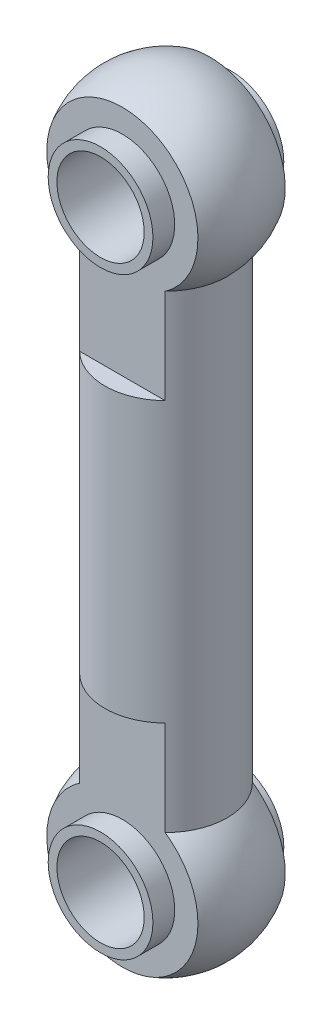
ISO-10303-21;
HEADER;
FILE_DESCRIPTION(('STEP AP214'),'2;1');
FILE_NAME('part.step','',(''),(''),'','','');
FILE_SCHEMA(('AUTOMOTIVE_DESIGN { 1 0 10303 214 1 1 1 1 }'));
ENDSEC;
DATA;
#1=APPLICATION_CONTEXT('core data for automotive mechanical design processes');
#2=APPLICATION_PROTOCOL_DEFINITION('international standard','automotive_design',2000,#1);
#3=PRODUCT_CONTEXT('',#1,'mechanical');
#4=PRODUCT('Part','Part','',(#3));
#5=PRODUCT_RELATED_PRODUCT_CATEGORY('part','',(#4));
#6=PRODUCT_DEFINITION_FORMATION('','',#4);
#7=PRODUCT_DEFINITION_CONTEXT('part definition',#1,'design');
#8=PRODUCT_DEFINITION('design','',#6,#7);
#9=PRODUCT_DEFINITION_SHAPE('','',#8);
#10=(LENGTH_UNIT() NAMED_UNIT(*) SI_UNIT(.MILLI.,.METRE.));
#11=(NAMED_UNIT(*) PLANE_ANGLE_UNIT() SI_UNIT($,.RADIAN.));
#12=(NAMED_UNIT(*) SI_UNIT($,.STERADIAN.) SOLID_ANGLE_UNIT());
#13=UNCERTAINTY_MEASURE_WITH_UNIT(LENGTH_MEASURE(1.E-05),#10,'distance_accuracy_value','');
#14=(GEOMETRIC_REPRESENTATION_CONTEXT(3) GLOBAL_UNCERTAINTY_ASSIGNED_CONTEXT((#13)) GLOBAL_UNIT_ASSIGNED_CONTEXT((#10,
#11,#12)) REPRESENTATION_CONTEXT('',''));
#15=CARTESIAN_POINT('',(0.,0.,0.));
#16=DIRECTION('',(0.,0.,1.));
#17=DIRECTION('',(1.,0.,0.));
#18=AXIS2_PLACEMENT_3D('',#15,#16,#17);
#19=CARTESIAN_POINT('',(0.,0.,2.5));
#20=DIRECTION('',(0.,0.,-1.));
#21=DIRECTION('',(-1.,0.,0.));
#22=AXIS2_PLACEMENT_3D('',#19,#20,#21);
#23=PLANE('',#22);
#24=CARTESIAN_POINT('',(0.,0.,2.5));
#25=DIRECTION('',(0.,0.,-1.));
#26=DIRECTION('',(-1.,0.,0.));
#27=AXIS2_PLACEMENT_3D('',#24,#25,#26);
#28=CIRCLE('',#27,4.33012701892219);
#29=CARTESIAN_POINT('',(-2.44948974278318,-3.57071421427142,2.5));
#30=VERTEX_POINT('',#29);
#31=CARTESIAN_POINT('',(2.44948974278318,-3.57071421427142,2.5));
#32=VERTEX_POINT('',#31);
#33=EDGE_CURVE('E63',#30,#32,#28,.T.);
#34=ORIENTED_EDGE('',*,*,#33,.F.);
#35=DIRECTION('',(0.,-1.,0.));
#36=VECTOR('',#35,1.);
#37=CARTESIAN_POINT('',(-2.44948974278318,0.,2.5));
#38=LINE('',#37,#36);
#39=CARTESIAN_POINT('',(-2.44948974278318,-9.,2.5));
#40=VERTEX_POINT('',#39);
#41=EDGE_CURVE('E185',#40,#30,#38,.F.);
#42=ORIENTED_EDGE('',*,*,#41,.F.);
#43=DIRECTION('',(1.,0.,0.));
#44=VECTOR('',#43,1.);
#45=CARTESIAN_POINT('',(-6.,-9.,2.5));
#46=LINE('',#45,#44);
#47=CARTESIAN_POINT('',(2.44948974278318,-9.,2.5));
#48=VERTEX_POINT('',#47);
#49=EDGE_CURVE('E182',#40,#48,#46,.T.);
#50=ORIENTED_EDGE('',*,*,#49,.T.);
#51=DIRECTION('',(0.,-1.,0.));
#52=VECTOR('',#51,1.);
#53=CARTESIAN_POINT('',(2.44948974278318,0.,2.5));
#54=LINE('',#53,#52);
#55=EDGE_CURVE('E188',#32,#48,#54,.T.);
#56=ORIENTED_EDGE('',*,*,#55,.F.);
#57=EDGE_LOOP('',(#34,#42,#50,#56));
#58=FACE_BOUND('',#57,.T.);
#59=CARTESIAN_POINT('',(0.,0.,2.5));
#60=DIRECTION('',(0.,0.,-1.));
#61=DIRECTION('',(-1.,0.,0.));
#62=AXIS2_PLACEMENT_3D('',#59,#60,#61);
#63=CIRCLE('',#62,3.);
#64=CARTESIAN_POINT('',(-3.,0.,2.5));
#65=VERTEX_POINT('',#64);
#66=EDGE_CURVE('E12',#65,#65,#63,.F.);
#67=ORIENTED_EDGE('',*,*,#66,.F.);
#68=EDGE_LOOP('',(#67));
#69=FACE_BOUND('',#68,.T.);
#70=ADVANCED_FACE('F39',(#58,#69),#23,.F.);
#71=CARTESIAN_POINT('',(0.,0.,-2.5));
#72=DIRECTION('',(0.,0.,1.));
#73=DIRECTION('',(-1.,0.,0.));
#74=AXIS2_PLACEMENT_3D('',#71,#72,#73);
#75=PLANE('',#74);
#76=CARTESIAN_POINT('',(0.,0.,-2.5));
#77=DIRECTION('',(0.,0.,1.));
#78=DIRECTION('',(1.,0.,0.));
#79=AXIS2_PLACEMENT_3D('',#76,#77,#78);
#80=CIRCLE('',#79,4.33012701892219);
#81=CARTESIAN_POINT('',(2.44948974278318,-3.57071421427142,-2.5));
#82=VERTEX_POINT('',#81);
#83=CARTESIAN_POINT('',(-2.44948974278318,-3.57071421427142,-2.5));
#84=VERTEX_POINT('',#83);
#85=EDGE_CURVE('E174',#82,#84,#80,.T.);
#86=ORIENTED_EDGE('',*,*,#85,.F.);
#87=DIRECTION('',(0.,-1.,0.));
#88=VECTOR('',#87,1.);
#89=CARTESIAN_POINT('',(2.44948974278318,0.,-2.5));
#90=LINE('',#89,#88);
#91=CARTESIAN_POINT('',(2.44948974278318,-9.,-2.5));
#92=VERTEX_POINT('',#91);
#93=EDGE_CURVE('E171',#92,#82,#90,.F.);
#94=ORIENTED_EDGE('',*,*,#93,.F.);
#95=DIRECTION('',(1.,0.,0.));
#96=VECTOR('',#95,1.);
#97=CARTESIAN_POINT('',(-6.,-9.,-2.5));
#98=LINE('',#97,#96);
#99=CARTESIAN_POINT('',(-2.44948974278318,-9.,-2.5));
#100=VERTEX_POINT('',#99);
#101=EDGE_CURVE('E55',#100,#92,#98,.T.);
#102=ORIENTED_EDGE('',*,*,#101,.F.);
#103=DIRECTION('',(0.,-1.,0.));
#104=VECTOR('',#103,1.);
#105=CARTESIAN_POINT('',(-2.44948974278318,0.,-2.5));
#106=LINE('',#105,#104);
#107=EDGE_CURVE('E177',#84,#100,#106,.T.);
#108=ORIENTED_EDGE('',*,*,#107,.F.);
#109=EDGE_LOOP('',(#86,#94,#102,#108));
#110=FACE_BOUND('',#109,.T.);
#111=CARTESIAN_POINT('',(0.,0.,-2.5));
#112=DIRECTION('',(0.,0.,1.));
#113=DIRECTION('',(1.,0.,0.));
#114=AXIS2_PLACEMENT_3D('',#111,#112,#113);
#115=CIRCLE('',#114,3.);
#116=CARTESIAN_POINT('',(3.,0.,-2.5));
#117=VERTEX_POINT('',#116);
#118=EDGE_CURVE('E43',#117,#117,#115,.F.);
#119=ORIENTED_EDGE('',*,*,#118,.F.);
#120=EDGE_LOOP('',(#119));
#121=FACE_BOUND('',#120,.T.);
#122=ADVANCED_FACE('F203',(#110,#121),#75,.F.);
#123=CARTESIAN_POINT('',(0.,0.,0.));
#124=DIRECTION('',(0.,-1.,0.));
#125=DIRECTION('',(1.,0.,0.));
#126=AXIS2_PLACEMENT_3D('',#123,#124,#125);
#127=SPHERICAL_SURFACE('',#126,5.);
#128=ORIENTED_EDGE('',*,*,#85,.T.);
#129=CARTESIAN_POINT('',(0.,-3.57071421427142,0.));
#130=DIRECTION('',(0.,-1.,0.));
#131=DIRECTION('',(0.,0.,-1.));
#132=AXIS2_PLACEMENT_3D('',#129,#130,#131);
#133=CIRCLE('',#132,3.5);
#134=EDGE_CURVE('E192',#30,#84,#133,.T.);
#135=ORIENTED_EDGE('',*,*,#134,.F.);
#136=ORIENTED_EDGE('',*,*,#33,.T.);
#137=EDGE_CURVE('E191',#82,#32,#133,.T.);
#138=ORIENTED_EDGE('',*,*,#137,.F.);
#139=EDGE_LOOP('',(#128,#135,#136,#138));
#140=FACE_BOUND('',#139,.T.);
#141=ADVANCED_FACE('F41',(#140),#127,.T.);
#142=CARTESIAN_POINT('',(0.,0.,0.));
#143=DIRECTION('',(0.,-1.,0.));
#144=DIRECTION('',(0.,0.,-1.));
#145=AXIS2_PLACEMENT_3D('',#142,#143,#144);
#146=CYLINDRICAL_SURFACE('',#145,3.5);
#147=ORIENTED_EDGE('',*,*,#107,.T.);
#148=CARTESIAN_POINT('',(0.,-9.,0.));
#149=DIRECTION('',(0.,-1.,0.));
#150=DIRECTION('',(0.,0.,-1.));
#151=AXIS2_PLACEMENT_3D('',#148,#149,#150);
#152=CIRCLE('',#151,3.5);
#153=EDGE_CURVE('E165',#100,#92,#152,.T.);
#154=ORIENTED_EDGE('',*,*,#153,.T.);
#155=ORIENTED_EDGE('',*,*,#93,.T.);
#156=ORIENTED_EDGE('',*,*,#137,.T.);
#157=ORIENTED_EDGE('',*,*,#55,.T.);
#158=CARTESIAN_POINT('',(0.,-9.,0.));
#159=DIRECTION('',(0.,1.,0.));
#160=DIRECTION('',(0.,0.,1.));
#161=AXIS2_PLACEMENT_3D('',#158,#159,#160);
#162=CIRCLE('',#161,3.5);
#163=EDGE_CURVE('E180',#40,#48,#162,.T.);
#164=ORIENTED_EDGE('',*,*,#163,.F.);
#165=ORIENTED_EDGE('',*,*,#41,.T.);
#166=ORIENTED_EDGE('',*,*,#134,.T.);
#167=EDGE_LOOP('',(#147,#154,#155,#156,#157,#164,#165,#166));
#168=FACE_BOUND('',#167,.T.);
#169=DIRECTION('',(0.,1.,0.));
#170=VECTOR('',#169,1.);
#171=CARTESIAN_POINT('',(-2.44948974278318,-34.,-2.5));
#172=LINE('',#171,#170);
#173=CARTESIAN_POINT('',(-2.44948974278318,-30.4292857857286,-2.5));
#174=VERTEX_POINT('',#173);
#175=CARTESIAN_POINT('',(-2.44948974278318,-25.,-2.5));
#176=VERTEX_POINT('',#175);
#177=EDGE_CURVE('E121',#174,#176,#172,.T.);
#178=ORIENTED_EDGE('',*,*,#177,.F.);
#179=CARTESIAN_POINT('',(0.,-30.4292857857286,0.));
#180=DIRECTION('',(0.,-1.,0.));
#181=DIRECTION('',(0.,0.,-1.));
#182=AXIS2_PLACEMENT_3D('',#179,#180,#181);
#183=CIRCLE('',#182,3.5);
#184=CARTESIAN_POINT('',(-2.44948974278318,-30.4292857857286,2.5));
#185=VERTEX_POINT('',#184);
#186=EDGE_CURVE('E107',#185,#174,#183,.T.);
#187=ORIENTED_EDGE('',*,*,#186,.F.);
#188=DIRECTION('',(0.,1.,0.));
#189=VECTOR('',#188,1.);
#190=CARTESIAN_POINT('',(-2.44948974278318,-34.,2.5));
#191=LINE('',#190,#189);
#192=CARTESIAN_POINT('',(-2.44948974278318,-25.,2.5));
#193=VERTEX_POINT('',#192);
#194=EDGE_CURVE('E143',#193,#185,#191,.F.);
#195=ORIENTED_EDGE('',*,*,#194,.F.);
#196=CARTESIAN_POINT('',(0.,-25.,0.));
#197=DIRECTION('',(0.,1.,0.));
#198=DIRECTION('',(0.,0.,1.));
#199=AXIS2_PLACEMENT_3D('',#196,#197,#198);
#200=CIRCLE('',#199,3.5);
#201=CARTESIAN_POINT('',(2.44948974278318,-25.,2.5));
#202=VERTEX_POINT('',#201);
#203=EDGE_CURVE('E128',#193,#202,#200,.T.);
#204=ORIENTED_EDGE('',*,*,#203,.T.);
#205=DIRECTION('',(0.,1.,0.));
#206=VECTOR('',#205,1.);
#207=CARTESIAN_POINT('',(2.44948974278318,-34.,2.5));
#208=LINE('',#207,#206);
#209=CARTESIAN_POINT('',(2.44948974278318,-30.4292857857286,2.5));
#210=VERTEX_POINT('',#209);
#211=EDGE_CURVE('E146',#210,#202,#208,.T.);
#212=ORIENTED_EDGE('',*,*,#211,.F.);
#213=CARTESIAN_POINT('',(2.44948974278318,-30.4292857857286,-2.5));
#214=VERTEX_POINT('',#213);
#215=EDGE_CURVE('E118',#214,#210,#183,.T.);
#216=ORIENTED_EDGE('',*,*,#215,.F.);
#217=DIRECTION('',(0.,1.,0.));
#218=VECTOR('',#217,1.);
#219=CARTESIAN_POINT('',(2.44948974278318,-34.,-2.5));
#220=LINE('',#219,#218);
#221=CARTESIAN_POINT('',(2.44948974278318,-25.,-2.5));
#222=VERTEX_POINT('',#221);
#223=EDGE_CURVE('E133',#222,#214,#220,.F.);
#224=ORIENTED_EDGE('',*,*,#223,.F.);
#225=CARTESIAN_POINT('',(0.,-25.,0.));
#226=DIRECTION('',(0.,-1.,0.));
#227=DIRECTION('',(0.,0.,-1.));
#228=AXIS2_PLACEMENT_3D('',#225,#226,#227);
#229=CIRCLE('',#228,3.5);
#230=EDGE_CURVE('E124',#176,#222,#229,.T.);
#231=ORIENTED_EDGE('',*,*,#230,.F.);
#232=EDGE_LOOP('',(#178,#187,#195,#204,#212,#216,#224,#231));
#233=FACE_BOUND('',#232,.T.);
#234=ADVANCED_FACE('F122',(#168,#233),#146,.T.);
#235=CARTESIAN_POINT('',(-6.,-9.,4.33112701892219));
#236=DIRECTION('',(0.,1.,0.));
#237=DIRECTION('',(0.,0.,1.));
#238=AXIS2_PLACEMENT_3D('',#235,#236,#237);
#239=PLANE('',#238);
#240=ORIENTED_EDGE('',*,*,#163,.T.);
#241=ORIENTED_EDGE('',*,*,#49,.F.);
#242=EDGE_LOOP('',(#240,#241));
#243=FACE_BOUND('',#242,.T.);
#244=ADVANCED_FACE('F220',(#243),#239,.T.);
#245=CARTESIAN_POINT('',(-6.,-9.,-4.33112701892219));
#246=DIRECTION('',(0.,-1.,0.));
#247=DIRECTION('',(0.,0.,-1.));
#248=AXIS2_PLACEMENT_3D('',#245,#246,#247);
#249=PLANE('',#248);
#250=ORIENTED_EDGE('',*,*,#101,.T.);
#251=ORIENTED_EDGE('',*,*,#153,.F.);
#252=EDGE_LOOP('',(#250,#251));
#253=FACE_BOUND('',#252,.T.);
#254=ADVANCED_FACE('F218',(#253),#249,.F.);
#255=CARTESIAN_POINT('',(0.,0.,3.75));
#256=DIRECTION('',(0.,0.,-1.));
#257=DIRECTION('',(-1.,0.,0.));
#258=AXIS2_PLACEMENT_3D('',#255,#256,#257);
#259=CYLINDRICAL_SURFACE('',#258,3.);
#260=CARTESIAN_POINT('',(0.,0.,-3.75));
#261=DIRECTION('',(0.,0.,1.));
#262=DIRECTION('',(1.,0.,0.));
#263=AXIS2_PLACEMENT_3D('',#260,#261,#262);
#264=CIRCLE('',#263,3.);
#265=CARTESIAN_POINT('',(3.,0.,-3.75));
#266=VERTEX_POINT('',#265);
#267=EDGE_CURVE('E158',#266,#266,#264,.T.);
#268=ORIENTED_EDGE('',*,*,#267,.T.);
#269=EDGE_LOOP('',(#268));
#270=FACE_BOUND('',#269,.T.);
#271=ORIENTED_EDGE('',*,*,#118,.T.);
#272=EDGE_LOOP('',(#271));
#273=FACE_BOUND('',#272,.T.);
#274=ADVANCED_FACE('F201',(#270,#273),#259,.T.);
#275=CARTESIAN_POINT('',(0.,0.,-3.75));
#276=DIRECTION('',(0.,0.,1.));
#277=DIRECTION('',(1.,0.,0.));
#278=AXIS2_PLACEMENT_3D('',#275,#276,#277);
#279=PLANE('',#278);
#280=ORIENTED_EDGE('',*,*,#267,.F.);
#281=EDGE_LOOP('',(#280));
#282=FACE_BOUND('',#281,.T.);
#283=CARTESIAN_POINT('',(0.,0.,-3.75));
#284=DIRECTION('',(0.,0.,1.));
#285=DIRECTION('',(1.,0.,0.));
#286=AXIS2_PLACEMENT_3D('',#283,#284,#285);
#287=CIRCLE('',#286,2.5);
#288=CARTESIAN_POINT('',(2.5,0.,-3.75));
#289=VERTEX_POINT('',#288);
#290=EDGE_CURVE('E159',#289,#289,#287,.T.);
#291=ORIENTED_EDGE('',*,*,#290,.T.);
#292=EDGE_LOOP('',(#291));
#293=FACE_BOUND('',#292,.T.);
#294=ADVANCED_FACE('F228',(#282,#293),#279,.F.);
#295=CARTESIAN_POINT('',(0.,0.,-5.));
#296=DIRECTION('',(0.,0.,1.));
#297=DIRECTION('',(1.,0.,0.));
#298=AXIS2_PLACEMENT_3D('',#295,#296,#297);
#299=CYLINDRICAL_SURFACE('',#298,2.5);
#300=ORIENTED_EDGE('',*,*,#290,.F.);
#301=EDGE_LOOP('',(#300));
#302=FACE_BOUND('',#301,.T.);
#303=CARTESIAN_POINT('',(0.,0.,3.75));
#304=DIRECTION('',(0.,0.,1.));
#305=DIRECTION('',(1.,0.,0.));
#306=AXIS2_PLACEMENT_3D('',#303,#304,#305);
#307=CIRCLE('',#306,2.5);
#308=CARTESIAN_POINT('',(2.5,0.,3.75));
#309=VERTEX_POINT('',#308);
#310=EDGE_CURVE('E155',#309,#309,#307,.T.);
#311=ORIENTED_EDGE('',*,*,#310,.T.);
#312=EDGE_LOOP('',(#311));
#313=FACE_BOUND('',#312,.T.);
#314=ADVANCED_FACE('F225',(#302,#313),#299,.F.);
#315=CARTESIAN_POINT('',(0.,0.,3.75));
#316=DIRECTION('',(0.,0.,1.));
#317=DIRECTION('',(1.,0.,0.));
#318=AXIS2_PLACEMENT_3D('',#315,#316,#317);
#319=CIRCLE('',#318,3.);
#320=CARTESIAN_POINT('',(3.,0.,3.75));
#321=VERTEX_POINT('',#320);
#322=EDGE_CURVE('E162',#321,#321,#319,.T.);
#323=ORIENTED_EDGE('',*,*,#322,.F.);
#324=EDGE_LOOP('',(#323));
#325=FACE_BOUND('',#324,.T.);
#326=ORIENTED_EDGE('',*,*,#66,.T.);
#327=EDGE_LOOP('',(#326));
#328=FACE_BOUND('',#327,.T.);
#329=ADVANCED_FACE('F216',(#325,#328),#259,.T.);
#330=CARTESIAN_POINT('',(0.,0.,3.75));
#331=DIRECTION('',(0.,0.,1.));
#332=DIRECTION('',(1.,0.,0.));
#333=AXIS2_PLACEMENT_3D('',#330,#331,#332);
#334=PLANE('',#333);
#335=ORIENTED_EDGE('',*,*,#322,.T.);
#336=EDGE_LOOP('',(#335));
#337=FACE_BOUND('',#336,.T.);
#338=ORIENTED_EDGE('',*,*,#310,.F.);
#339=EDGE_LOOP('',(#338));
#340=FACE_BOUND('',#339,.T.);
#341=ADVANCED_FACE('F271',(#337,#340),#334,.T.);
#342=CARTESIAN_POINT('',(0.,-34.,2.5));
#343=DIRECTION('',(0.,0.,-1.));
#344=DIRECTION('',(-1.,0.,0.));
#345=AXIS2_PLACEMENT_3D('',#342,#343,#344);
#346=PLANE('',#345);
#347=CARTESIAN_POINT('',(0.,-34.,2.5));
#348=DIRECTION('',(0.,0.,1.));
#349=DIRECTION('',(-1.,0.,0.));
#350=AXIS2_PLACEMENT_3D('',#347,#348,#349);
#351=CIRCLE('',#350,4.33012701892219);
#352=EDGE_CURVE('E113',#185,#210,#351,.T.);
#353=ORIENTED_EDGE('',*,*,#352,.T.);
#354=ORIENTED_EDGE('',*,*,#211,.T.);
#355=DIRECTION('',(1.,0.,0.));
#356=VECTOR('',#355,1.);
#357=CARTESIAN_POINT('',(-6.,-25.,2.5));
#358=LINE('',#357,#356);
#359=EDGE_CURVE('E140',#193,#202,#358,.T.);
#360=ORIENTED_EDGE('',*,*,#359,.F.);
#361=ORIENTED_EDGE('',*,*,#194,.T.);
#362=EDGE_LOOP('',(#353,#354,#360,#361));
#363=FACE_BOUND('',#362,.T.);
#364=CARTESIAN_POINT('',(0.,-34.,2.5));
#365=DIRECTION('',(0.,0.,1.));
#366=DIRECTION('',(-1.,0.,0.));
#367=AXIS2_PLACEMENT_3D('',#364,#365,#366);
#368=CIRCLE('',#367,3.);
#369=CARTESIAN_POINT('',(-3.,-34.,2.5));
#370=VERTEX_POINT('',#369);
#371=EDGE_CURVE('E154',#370,#370,#368,.F.);
#372=ORIENTED_EDGE('',*,*,#371,.T.);
#373=EDGE_LOOP('',(#372));
#374=FACE_BOUND('',#373,.T.);
#375=ADVANCED_FACE('F279',(#363,#374),#346,.F.);
#376=CARTESIAN_POINT('',(0.,-34.,-2.5));
#377=DIRECTION('',(0.,0.,1.));
#378=DIRECTION('',(-1.,0.,0.));
#379=AXIS2_PLACEMENT_3D('',#376,#377,#378);
#380=PLANE('',#379);
#381=CARTESIAN_POINT('',(0.,-34.,-2.5));
#382=DIRECTION('',(0.,0.,-1.));
#383=DIRECTION('',(1.,0.,0.));
#384=AXIS2_PLACEMENT_3D('',#381,#382,#383);
#385=CIRCLE('',#384,4.33012701892219);
#386=EDGE_CURVE('E111',#214,#174,#385,.T.);
#387=ORIENTED_EDGE('',*,*,#386,.T.);
#388=ORIENTED_EDGE('',*,*,#177,.T.);
#389=DIRECTION('',(1.,0.,0.));
#390=VECTOR('',#389,1.);
#391=CARTESIAN_POINT('',(-6.,-25.,-2.5));
#392=LINE('',#391,#390);
#393=EDGE_CURVE('E135',#176,#222,#392,.T.);
#394=ORIENTED_EDGE('',*,*,#393,.T.);
#395=ORIENTED_EDGE('',*,*,#223,.T.);
#396=EDGE_LOOP('',(#387,#388,#394,#395));
#397=FACE_BOUND('',#396,.T.);
#398=CARTESIAN_POINT('',(0.,-34.,-2.5));
#399=DIRECTION('',(0.,0.,-1.));
#400=DIRECTION('',(1.,0.,0.));
#401=AXIS2_PLACEMENT_3D('',#398,#399,#400);
#402=CIRCLE('',#401,3.);
#403=CARTESIAN_POINT('',(3.,-34.,-2.5));
#404=VERTEX_POINT('',#403);
#405=EDGE_CURVE('E151',#404,#404,#402,.F.);
#406=ORIENTED_EDGE('',*,*,#405,.T.);
#407=EDGE_LOOP('',(#406));
#408=FACE_BOUND('',#407,.T.);
#409=ADVANCED_FACE('F131',(#397,#408),#380,.F.);
#410=CARTESIAN_POINT('',(0.,-34.,0.));
#411=DIRECTION('',(0.,1.,0.));
#412=DIRECTION('',(1.,0.,0.));
#413=AXIS2_PLACEMENT_3D('',#410,#411,#412);
#414=SPHERICAL_SURFACE('',#413,5.);
#415=ORIENTED_EDGE('',*,*,#386,.F.);
#416=ORIENTED_EDGE('',*,*,#215,.T.);
#417=ORIENTED_EDGE('',*,*,#352,.F.);
#418=ORIENTED_EDGE('',*,*,#186,.T.);
#419=EDGE_LOOP('',(#415,#416,#417,#418));
#420=FACE_BOUND('',#419,.T.);
#421=ADVANCED_FACE('F109',(#420),#414,.T.);
#422=CARTESIAN_POINT('',(-6.,-25.,4.33112701892219));
#423=DIRECTION('',(0.,-1.,0.));
#424=DIRECTION('',(0.,0.,1.));
#425=AXIS2_PLACEMENT_3D('',#422,#423,#424);
#426=PLANE('',#425);
#427=ORIENTED_EDGE('',*,*,#203,.F.);
#428=ORIENTED_EDGE('',*,*,#359,.T.);
#429=EDGE_LOOP('',(#427,#428));
#430=FACE_BOUND('',#429,.T.);
#431=ADVANCED_FACE('F313',(#430),#426,.T.);
#432=CARTESIAN_POINT('',(-6.,-25.,-4.33112701892219));
#433=DIRECTION('',(0.,1.,0.));
#434=DIRECTION('',(0.,0.,-1.));
#435=AXIS2_PLACEMENT_3D('',#432,#433,#434);
#436=PLANE('',#435);
#437=ORIENTED_EDGE('',*,*,#393,.F.);
#438=ORIENTED_EDGE('',*,*,#230,.T.);
#439=EDGE_LOOP('',(#437,#438));
#440=FACE_BOUND('',#439,.T.);
#441=ADVANCED_FACE('F323',(#440),#436,.F.);
#442=CARTESIAN_POINT('',(0.,-34.,3.75));
#443=DIRECTION('',(0.,0.,-1.));
#444=DIRECTION('',(-1.,0.,0.));
#445=AXIS2_PLACEMENT_3D('',#442,#443,#444);
#446=CYLINDRICAL_SURFACE('',#445,3.);
#447=CARTESIAN_POINT('',(0.,-34.,-3.75));
#448=DIRECTION('',(0.,0.,-1.));
#449=DIRECTION('',(1.,0.,0.));
#450=AXIS2_PLACEMENT_3D('',#447,#448,#449);
#451=CIRCLE('',#450,3.);
#452=CARTESIAN_POINT('',(3.,-34.,-3.75));
#453=VERTEX_POINT('',#452);
#454=EDGE_CURVE('E409',#453,#453,#451,.T.);
#455=ORIENTED_EDGE('',*,*,#454,.F.);
#456=EDGE_LOOP('',(#455));
#457=FACE_BOUND('',#456,.T.);
#458=ORIENTED_EDGE('',*,*,#405,.F.);
#459=EDGE_LOOP('',(#458));
#460=FACE_BOUND('',#459,.T.);
#461=ADVANCED_FACE('F333',(#457,#460),#446,.T.);
#462=CARTESIAN_POINT('',(0.,-34.,-3.75));
#463=DIRECTION('',(0.,0.,1.));
#464=DIRECTION('',(1.,0.,0.));
#465=AXIS2_PLACEMENT_3D('',#462,#463,#464);
#466=PLANE('',#465);
#467=ORIENTED_EDGE('',*,*,#454,.T.);
#468=EDGE_LOOP('',(#467));
#469=FACE_BOUND('',#468,.T.);
#470=CARTESIAN_POINT('',(0.,-34.,-3.75));
#471=DIRECTION('',(0.,0.,-1.));
#472=DIRECTION('',(1.,0.,0.));
#473=AXIS2_PLACEMENT_3D('',#470,#471,#472);
#474=CIRCLE('',#473,2.5);
#475=CARTESIAN_POINT('',(2.5,-34.,-3.75));
#476=VERTEX_POINT('',#475);
#477=EDGE_CURVE('E410',#476,#476,#474,.T.);
#478=ORIENTED_EDGE('',*,*,#477,.F.);
#479=EDGE_LOOP('',(#478));
#480=FACE_BOUND('',#479,.T.);
#481=ADVANCED_FACE('F343',(#469,#480),#466,.F.);
#482=CARTESIAN_POINT('',(0.,-34.,-5.));
#483=DIRECTION('',(0.,0.,1.));
#484=DIRECTION('',(1.,0.,0.));
#485=AXIS2_PLACEMENT_3D('',#482,#483,#484);
#486=CYLINDRICAL_SURFACE('',#485,2.5);
#487=ORIENTED_EDGE('',*,*,#477,.T.);
#488=EDGE_LOOP('',(#487));
#489=FACE_BOUND('',#488,.T.);
#490=CARTESIAN_POINT('',(0.,-34.,3.75));
#491=DIRECTION('',(0.,0.,-1.));
#492=DIRECTION('',(1.,0.,0.));
#493=AXIS2_PLACEMENT_3D('',#490,#491,#492);
#494=CIRCLE('',#493,2.5);
#495=CARTESIAN_POINT('',(2.5,-34.,3.75));
#496=VERTEX_POINT('',#495);
#497=EDGE_CURVE('E407',#496,#496,#494,.T.);
#498=ORIENTED_EDGE('',*,*,#497,.F.);
#499=EDGE_LOOP('',(#498));
#500=FACE_BOUND('',#499,.T.);
#501=ADVANCED_FACE('F354',(#489,#500),#486,.F.);
#502=CARTESIAN_POINT('',(0.,-34.,3.75));
#503=DIRECTION('',(0.,0.,-1.));
#504=DIRECTION('',(1.,0.,0.));
#505=AXIS2_PLACEMENT_3D('',#502,#503,#504);
#506=CIRCLE('',#505,3.);
#507=CARTESIAN_POINT('',(3.,-34.,3.75));
#508=VERTEX_POINT('',#507);
#509=EDGE_CURVE('E404',#508,#508,#506,.T.);
#510=ORIENTED_EDGE('',*,*,#509,.T.);
#511=EDGE_LOOP('',(#510));
#512=FACE_BOUND('',#511,.T.);
#513=ORIENTED_EDGE('',*,*,#371,.F.);
#514=EDGE_LOOP('',(#513));
#515=FACE_BOUND('',#514,.T.);
#516=ADVANCED_FACE('F346',(#512,#515),#446,.T.);
#517=CARTESIAN_POINT('',(0.,-34.,3.75));
#518=DIRECTION('',(0.,0.,1.));
#519=DIRECTION('',(1.,0.,0.));
#520=AXIS2_PLACEMENT_3D('',#517,#518,#519);
#521=PLANE('',#520);
#522=ORIENTED_EDGE('',*,*,#509,.F.);
#523=EDGE_LOOP('',(#522));
#524=FACE_BOUND('',#523,.T.);
#525=ORIENTED_EDGE('',*,*,#497,.T.);
#526=EDGE_LOOP('',(#525));
#527=FACE_BOUND('',#526,.T.);
#528=ADVANCED_FACE('F376',(#524,#527),#521,.T.);
#529=CLOSED_SHELL('',(#70,#122,#141,#234,#244,#254,#274,#294,#314,#329,#341,#375,#409,#421,#431,
#441,#461,#481,#501,#516,#528));
#530=CARTESIAN_POINT('',(0.,-7.,0.));
#531=DIRECTION('',(0.,-1.,0.));
#532=DIRECTION('',(0.,0.,-1.));
#533=AXIS2_PLACEMENT_3D('',#530,#531,#532);
#534=PLANE('',#533);
#535=CARTESIAN_POINT('',(0.,-7.,0.));
#536=DIRECTION('',(0.,-1.,0.));
#537=DIRECTION('',(0.,0.,-1.));
#538=AXIS2_PLACEMENT_3D('',#535,#536,#537);
#539=CIRCLE('',#538,1.75);
#540=CARTESIAN_POINT('',(0.,-7.,-1.75));
#541=VERTEX_POINT('',#540);
#542=EDGE_CURVE('E194',#541,#541,#539,.T.);
#543=ORIENTED_EDGE('',*,*,#542,.T.);
#544=EDGE_LOOP('',(#543));
#545=FACE_BOUND('',#544,.T.);
#546=ADVANCED_FACE('F236',(#545),#534,.T.);
#547=CARTESIAN_POINT('',(0.,0.,0.));
#548=DIRECTION('',(0.,-1.,0.));
#549=DIRECTION('',(0.,0.,-1.));
#550=AXIS2_PLACEMENT_3D('',#547,#548,#549);
#551=CYLINDRICAL_SURFACE('',#550,1.75);
#552=ORIENTED_EDGE('',*,*,#542,.F.);
#553=EDGE_LOOP('',(#552));
#554=FACE_BOUND('',#553,.T.);
#555=CARTESIAN_POINT('',(0.,-27.,0.));
#556=DIRECTION('',(0.,-1.,0.));
#557=DIRECTION('',(0.,0.,-1.));
#558=AXIS2_PLACEMENT_3D('',#555,#556,#557);
#559=CIRCLE('',#558,1.75);
#560=CARTESIAN_POINT('',(0.,-27.,-1.75));
#561=VERTEX_POINT('',#560);
#562=EDGE_CURVE('E117',#561,#561,#559,.T.);
#563=ORIENTED_EDGE('',*,*,#562,.T.);
#564=EDGE_LOOP('',(#563));
#565=FACE_BOUND('',#564,.T.);
#566=ADVANCED_FACE('F233',(#554,#565),#551,.F.);
#567=CARTESIAN_POINT('',(0.,-27.,0.));
#568=DIRECTION('',(0.,1.,0.));
#569=DIRECTION('',(0.,0.,-1.));
#570=AXIS2_PLACEMENT_3D('',#567,#568,#569);
#571=PLANE('',#570);
#572=ORIENTED_EDGE('',*,*,#562,.F.);
#573=EDGE_LOOP('',(#572));
#574=FACE_BOUND('',#573,.T.);
#575=ADVANCED_FACE('F235',(#574),#571,.T.);
#576=CLOSED_SHELL('',(#546,#566,#575));
#577=ORIENTED_CLOSED_SHELL('',*,#576,.T.);
#578=BREP_WITH_VOIDS('B2',#529,(#577));
#579=ADVANCED_BREP_SHAPE_REPRESENTATION('',(#18,#578),#14);
#580=SHAPE_DEFINITION_REPRESENTATION(#9,#579);
ENDSEC;
END-ISO-10303-21;
